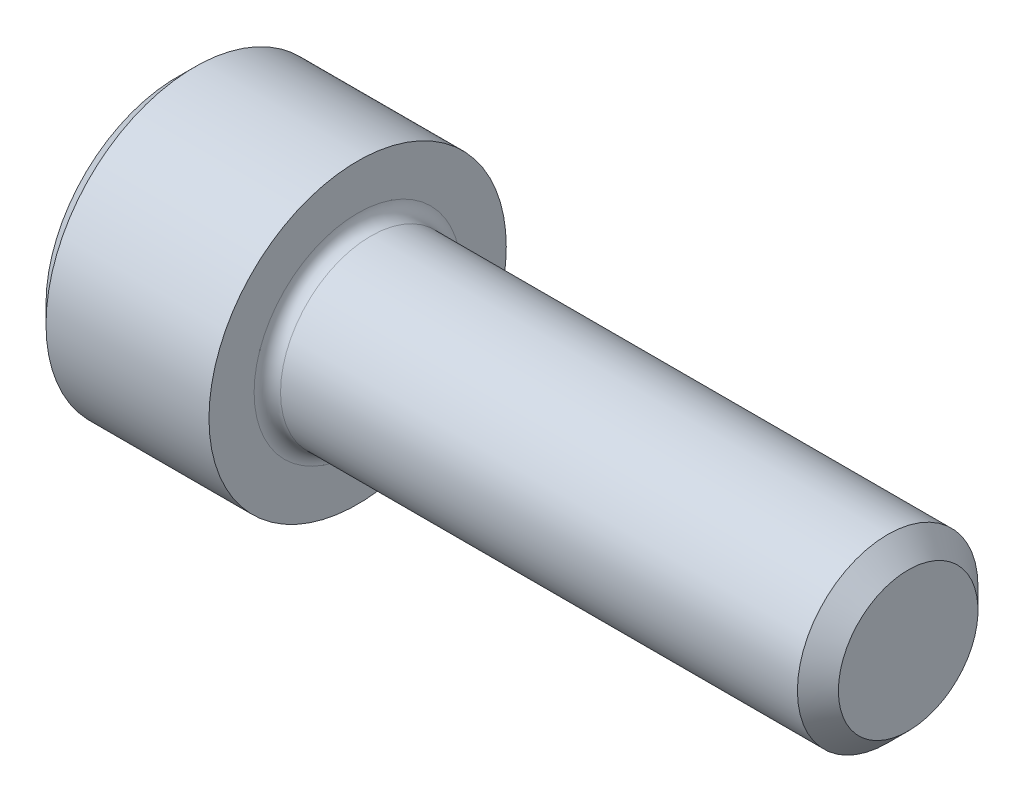
ISO-10303-21;
HEADER;
FILE_DESCRIPTION(('STEP AP214'),'2;1');
FILE_NAME('part.step','',(''),(''),'','','');
FILE_SCHEMA(('AUTOMOTIVE_DESIGN { 1 0 10303 214 1 1 1 1 }'));
ENDSEC;
DATA;
#1=APPLICATION_CONTEXT('core data for automotive mechanical design processes');
#2=APPLICATION_PROTOCOL_DEFINITION('international standard','automotive_design',2000,#1);
#3=PRODUCT_CONTEXT('',#1,'mechanical');
#4=PRODUCT('Part','Part','',(#3));
#5=PRODUCT_RELATED_PRODUCT_CATEGORY('part','',(#4));
#6=PRODUCT_DEFINITION_FORMATION('','',#4);
#7=PRODUCT_DEFINITION_CONTEXT('part definition',#1,'design');
#8=PRODUCT_DEFINITION('design','',#6,#7);
#9=PRODUCT_DEFINITION_SHAPE('','',#8);
#10=(LENGTH_UNIT() NAMED_UNIT(*) SI_UNIT(.MILLI.,.METRE.));
#11=(NAMED_UNIT(*) PLANE_ANGLE_UNIT() SI_UNIT($,.RADIAN.));
#12=(NAMED_UNIT(*) SI_UNIT($,.STERADIAN.) SOLID_ANGLE_UNIT());
#13=UNCERTAINTY_MEASURE_WITH_UNIT(LENGTH_MEASURE(1.E-05),#10,'distance_accuracy_value','');
#14=(GEOMETRIC_REPRESENTATION_CONTEXT(3) GLOBAL_UNCERTAINTY_ASSIGNED_CONTEXT((#13)) GLOBAL_UNIT_ASSIGNED_CONTEXT((#10,
#11,#12)) REPRESENTATION_CONTEXT('',''));
#15=CARTESIAN_POINT('',(0.,0.,0.));
#16=DIRECTION('',(0.,0.,1.));
#17=DIRECTION('',(1.,0.,0.));
#18=AXIS2_PLACEMENT_3D('',#15,#16,#17);
#19=CARTESIAN_POINT('',(0.,0.,0.));
#20=DIRECTION('',(-1.,0.,0.));
#21=DIRECTION('',(0.,0.,1.));
#22=AXIS2_PLACEMENT_3D('',#19,#20,#21);
#23=PLANE('',#22);
#24=DIRECTION('',(0.,-0.499999999999998,0.86602540378444));
#25=VECTOR('',#24,1.);
#26=CARTESIAN_POINT('',(0.,2.05305755723831,0.));
#27=LINE('',#26,#25);
#28=CARTESIAN_POINT('',(0.,2.05305755723831,0.));
#29=VERTEX_POINT('',#28);
#30=CARTESIAN_POINT('',(0.,1.02652877861916,1.778));
#31=VERTEX_POINT('',#30);
#32=EDGE_CURVE('E381',#29,#31,#27,.T.);
#33=ORIENTED_EDGE('',*,*,#32,.T.);
#34=DIRECTION('',(0.,1.,0.));
#35=VECTOR('',#34,1.);
#36=CARTESIAN_POINT('',(0.,-1.02652877861915,1.778));
#37=LINE('',#36,#35);
#38=CARTESIAN_POINT('',(0.,-1.02652877861915,1.778));
#39=VERTEX_POINT('',#38);
#40=EDGE_CURVE('E132',#39,#31,#37,.T.);
#41=ORIENTED_EDGE('',*,*,#40,.F.);
#42=DIRECTION('',(0.,-0.500000000000001,-0.866025403784438));
#43=VECTOR('',#42,1.);
#44=CARTESIAN_POINT('',(0.,-1.02652877861915,1.778));
#45=LINE('',#44,#43);
#46=CARTESIAN_POINT('',(0.,-2.05305755723831,0.));
#47=VERTEX_POINT('',#46);
#48=EDGE_CURVE('E390',#39,#47,#45,.T.);
#49=ORIENTED_EDGE('',*,*,#48,.T.);
#50=DIRECTION('',(0.,0.499999999999998,-0.866025403784439));
#51=VECTOR('',#50,1.);
#52=CARTESIAN_POINT('',(0.,-2.05305755723831,0.));
#53=LINE('',#52,#51);
#54=CARTESIAN_POINT('',(0.,-1.02652877861916,-1.778));
#55=VERTEX_POINT('',#54);
#56=EDGE_CURVE('E387',#47,#55,#53,.T.);
#57=ORIENTED_EDGE('',*,*,#56,.T.);
#58=DIRECTION('',(0.,-1.,0.));
#59=VECTOR('',#58,1.);
#60=CARTESIAN_POINT('',(0.,1.02652877861915,-1.778));
#61=LINE('',#60,#59);
#62=CARTESIAN_POINT('',(0.,1.02652877861915,-1.778));
#63=VERTEX_POINT('',#62);
#64=EDGE_CURVE('E391',#63,#55,#61,.T.);
#65=ORIENTED_EDGE('',*,*,#64,.F.);
#66=DIRECTION('',(0.,-0.500000000000001,-0.866025403784438));
#67=VECTOR('',#66,1.);
#68=CARTESIAN_POINT('',(0.,2.05305755723831,0.));
#69=LINE('',#68,#67);
#70=EDGE_CURVE('E127',#29,#63,#69,.T.);
#71=ORIENTED_EDGE('',*,*,#70,.F.);
#72=EDGE_LOOP('',(#33,#41,#49,#57,#65,#71));
#73=FACE_BOUND('',#72,.T.);
#74=CARTESIAN_POINT('',(0.,0.,0.));
#75=DIRECTION('',(-1.,0.,0.));
#76=DIRECTION('',(0.,0.,1.));
#77=AXIS2_PLACEMENT_3D('',#74,#75,#76);
#78=CIRCLE('',#77,3.0226);
#79=CARTESIAN_POINT('',(0.,0.,3.0226));
#80=VERTEX_POINT('',#79);
#81=EDGE_CURVE('E148',#80,#80,#78,.T.);
#82=ORIENTED_EDGE('',*,*,#81,.T.);
#83=EDGE_LOOP('',(#82));
#84=FACE_BOUND('',#83,.T.);
#85=ADVANCED_FACE('F39',(#73,#84),#23,.T.);
#86=CARTESIAN_POINT('',(16.8656,1.61036,0.));
#87=DIRECTION('',(1.,0.,0.));
#88=DIRECTION('',(0.,0.,-1.));
#89=AXIS2_PLACEMENT_3D('',#86,#87,#88);
#90=PLANE('',#89);
#91=CARTESIAN_POINT('',(16.8656,0.,0.));
#92=DIRECTION('',(-1.,0.,0.));
#93=DIRECTION('',(0.,0.,1.));
#94=AXIS2_PLACEMENT_3D('',#91,#92,#93);
#95=CIRCLE('',#94,1.61036);
#96=CARTESIAN_POINT('',(16.8656,0.,1.61036));
#97=VERTEX_POINT('',#96);
#98=EDGE_CURVE('E160',#97,#97,#95,.T.);
#99=ORIENTED_EDGE('',*,*,#98,.F.);
#100=EDGE_LOOP('',(#99));
#101=FACE_BOUND('',#100,.T.);
#102=ADVANCED_FACE('F181',(#101),#90,.T.);
#103=CARTESIAN_POINT('',(16.8656,0.,0.));
#104=DIRECTION('',(-1.,0.,0.));
#105=DIRECTION('',(0.,0.,1.));
#106=AXIS2_PLACEMENT_3D('',#103,#104,#105);
#107=CONICAL_SURFACE('',#106,1.61036,0.785398163397526);
#108=CARTESIAN_POINT('',(16.39316,0.,0.));
#109=DIRECTION('',(-1.,0.,0.));
#110=DIRECTION('',(0.,0.,1.));
#111=AXIS2_PLACEMENT_3D('',#108,#109,#110);
#112=CIRCLE('',#111,2.08280000000003);
#113=CARTESIAN_POINT('',(16.39316,0.,2.08280000000003));
#114=VERTEX_POINT('',#113);
#115=EDGE_CURVE('E158',#114,#114,#112,.T.);
#116=ORIENTED_EDGE('',*,*,#115,.F.);
#117=EDGE_LOOP('',(#116));
#118=FACE_BOUND('',#117,.T.);
#119=ORIENTED_EDGE('',*,*,#98,.T.);
#120=EDGE_LOOP('',(#119));
#121=FACE_BOUND('',#120,.T.);
#122=ADVANCED_FACE('F190',(#118,#121),#107,.T.);
#123=CARTESIAN_POINT('',(-31.75,0.,0.));
#124=DIRECTION('',(-1.,0.,0.));
#125=DIRECTION('',(0.,0.,1.));
#126=AXIS2_PLACEMENT_3D('',#123,#124,#125);
#127=CYLINDRICAL_SURFACE('',#126,2.08280000000001);
#128=CARTESIAN_POINT('',(4.4704,0.,0.));
#129=DIRECTION('',(1.,0.,0.));
#130=DIRECTION('',(0.,0.,-1.));
#131=AXIS2_PLACEMENT_3D('',#128,#129,#130);
#132=CIRCLE('',#131,2.08280000000001);
#133=CARTESIAN_POINT('',(4.4704,0.,-2.08280000000001));
#134=VERTEX_POINT('',#133);
#135=EDGE_CURVE('E11',#134,#134,#132,.T.);
#136=ORIENTED_EDGE('',*,*,#135,.T.);
#137=EDGE_LOOP('',(#136));
#138=FACE_BOUND('',#137,.T.);
#139=ORIENTED_EDGE('',*,*,#115,.T.);
#140=EDGE_LOOP('',(#139));
#141=FACE_BOUND('',#140,.T.);
#142=ADVANCED_FACE('F200',(#138,#141),#127,.T.);
#143=CARTESIAN_POINT('',(4.1656,3.429,0.));
#144=DIRECTION('',(1.,0.,0.));
#145=DIRECTION('',(0.,0.,-1.));
#146=AXIS2_PLACEMENT_3D('',#143,#144,#145);
#147=PLANE('',#146);
#148=CARTESIAN_POINT('',(4.1656,0.,0.));
#149=DIRECTION('',(1.,0.,0.));
#150=DIRECTION('',(0.,0.,-1.));
#151=AXIS2_PLACEMENT_3D('',#148,#149,#150);
#152=CIRCLE('',#151,2.38760000000001);
#153=CARTESIAN_POINT('',(4.1656,0.,-2.38760000000001));
#154=VERTEX_POINT('',#153);
#155=EDGE_CURVE('E50',#154,#154,#152,.F.);
#156=ORIENTED_EDGE('',*,*,#155,.T.);
#157=EDGE_LOOP('',(#156));
#158=FACE_BOUND('',#157,.T.);
#159=CARTESIAN_POINT('',(4.1656,0.,0.));
#160=DIRECTION('',(-1.,0.,0.));
#161=DIRECTION('',(0.,0.,1.));
#162=AXIS2_PLACEMENT_3D('',#159,#160,#161);
#163=CIRCLE('',#162,3.429);
#164=CARTESIAN_POINT('',(4.1656,0.,3.429));
#165=VERTEX_POINT('',#164);
#166=EDGE_CURVE('E151',#165,#165,#163,.T.);
#167=ORIENTED_EDGE('',*,*,#166,.F.);
#168=EDGE_LOOP('',(#167));
#169=FACE_BOUND('',#168,.T.);
#170=ADVANCED_FACE('F165',(#158,#169),#147,.T.);
#171=CARTESIAN_POINT('',(-31.75,0.,0.));
#172=DIRECTION('',(-1.,0.,0.));
#173=DIRECTION('',(0.,0.,1.));
#174=AXIS2_PLACEMENT_3D('',#171,#172,#173);
#175=CYLINDRICAL_SURFACE('',#174,3.429);
#176=ORIENTED_EDGE('',*,*,#166,.T.);
#177=EDGE_LOOP('',(#176));
#178=FACE_BOUND('',#177,.T.);
#179=CARTESIAN_POINT('',(0.406400000000001,0.,0.));
#180=DIRECTION('',(-1.,0.,0.));
#181=DIRECTION('',(0.,0.,1.));
#182=AXIS2_PLACEMENT_3D('',#179,#180,#181);
#183=CIRCLE('',#182,3.429);
#184=CARTESIAN_POINT('',(0.406400000000001,0.,3.429));
#185=VERTEX_POINT('',#184);
#186=EDGE_CURVE('E147',#185,#185,#183,.T.);
#187=ORIENTED_EDGE('',*,*,#186,.F.);
#188=EDGE_LOOP('',(#187));
#189=FACE_BOUND('',#188,.T.);
#190=ADVANCED_FACE('F180',(#178,#189),#175,.T.);
#191=CARTESIAN_POINT('',(0.,0.,0.));
#192=DIRECTION('',(1.,0.,0.));
#193=DIRECTION('',(0.,0.,-1.));
#194=AXIS2_PLACEMENT_3D('',#191,#192,#193);
#195=CONICAL_SURFACE('',#194,3.0226,0.785398163397449);
#196=ORIENTED_EDGE('',*,*,#186,.T.);
#197=EDGE_LOOP('',(#196));
#198=FACE_BOUND('',#197,.T.);
#199=ORIENTED_EDGE('',*,*,#81,.F.);
#200=EDGE_LOOP('',(#199));
#201=FACE_BOUND('',#200,.T.);
#202=ADVANCED_FACE('F166',(#198,#201),#195,.T.);
#203=CARTESIAN_POINT('',(4.4704,0.,0.));
#204=DIRECTION('',(1.,0.,0.));
#205=DIRECTION('',(0.,0.,-1.));
#206=AXIS2_PLACEMENT_3D('',#203,#204,#205);
#207=TOROIDAL_SURFACE('',#206,2.38760000000001,0.3048);
#208=ORIENTED_EDGE('',*,*,#135,.F.);
#209=EDGE_LOOP('',(#208));
#210=FACE_BOUND('',#209,.T.);
#211=ORIENTED_EDGE('',*,*,#155,.F.);
#212=EDGE_LOOP('',(#211));
#213=FACE_BOUND('',#212,.T.);
#214=ADVANCED_FACE('F41',(#210,#213),#207,.F.);
#215=CARTESIAN_POINT('',(1.9558,2.05305755723831,0.));
#216=DIRECTION('',(0.,-0.86602540378444,-0.499999999999998));
#217=DIRECTION('',(0.,0.499999999999998,-0.86602540378444));
#218=AXIS2_PLACEMENT_3D('',#215,#216,#217);
#219=PLANE('',#218);
#220=ORIENTED_EDGE('',*,*,#32,.F.);
#221=DIRECTION('',(-1.,0.,0.));
#222=VECTOR('',#221,1.);
#223=CARTESIAN_POINT('',(1.9558,2.05305755723831,0.));
#224=LINE('',#223,#222);
#225=CARTESIAN_POINT('',(1.9558,2.05305755723831,0.));
#226=VERTEX_POINT('',#225);
#227=EDGE_CURVE('E372',#226,#29,#224,.T.);
#228=ORIENTED_EDGE('',*,*,#227,.F.);
#229=DIRECTION('',(0.,-0.499999999999998,0.86602540378444));
#230=VECTOR('',#229,1.);
#231=CARTESIAN_POINT('',(1.9558,2.05305755723831,0.));
#232=LINE('',#231,#230);
#233=CARTESIAN_POINT('',(1.9558,1.53979316792873,0.888999999999997));
#234=VERTEX_POINT('',#233);
#235=EDGE_CURVE('E125',#226,#234,#232,.T.);
#236=ORIENTED_EDGE('',*,*,#235,.T.);
#237=CARTESIAN_POINT('',(1.9558,1.02652877861916,1.778));
#238=VERTEX_POINT('',#237);
#239=EDGE_CURVE('E113',#234,#238,#232,.T.);
#240=ORIENTED_EDGE('',*,*,#239,.T.);
#241=DIRECTION('',(-1.,0.,0.));
#242=VECTOR('',#241,1.);
#243=CARTESIAN_POINT('',(1.9558,1.02652877861916,1.778));
#244=LINE('',#243,#242);
#245=EDGE_CURVE('E130',#238,#31,#244,.T.);
#246=ORIENTED_EDGE('',*,*,#245,.T.);
#247=EDGE_LOOP('',(#220,#228,#236,#240,#246));
#248=FACE_BOUND('',#247,.T.);
#249=ADVANCED_FACE('F128',(#248),#219,.T.);
#250=CARTESIAN_POINT('',(1.9558,-1.02652877861915,1.778));
#251=DIRECTION('',(0.,0.,1.));
#252=DIRECTION('',(0.,-1.,0.));
#253=AXIS2_PLACEMENT_3D('',#250,#251,#252);
#254=PLANE('',#253);
#255=ORIENTED_EDGE('',*,*,#40,.T.);
#256=ORIENTED_EDGE('',*,*,#245,.F.);
#257=DIRECTION('',(0.,1.,0.));
#258=VECTOR('',#257,1.);
#259=CARTESIAN_POINT('',(1.9558,-1.02652877861915,1.778));
#260=LINE('',#259,#258);
#261=CARTESIAN_POINT('',(1.9558,0.,1.778));
#262=VERTEX_POINT('',#261);
#263=EDGE_CURVE('E109',#262,#238,#260,.T.);
#264=ORIENTED_EDGE('',*,*,#263,.F.);
#265=CARTESIAN_POINT('',(1.9558,-1.02652877861915,1.778));
#266=VERTEX_POINT('',#265);
#267=EDGE_CURVE('E122',#266,#262,#260,.T.);
#268=ORIENTED_EDGE('',*,*,#267,.F.);
#269=DIRECTION('',(-1.,0.,0.));
#270=VECTOR('',#269,1.);
#271=CARTESIAN_POINT('',(1.9558,-1.02652877861915,1.778));
#272=LINE('',#271,#270);
#273=EDGE_CURVE('E139',#266,#39,#272,.T.);
#274=ORIENTED_EDGE('',*,*,#273,.T.);
#275=EDGE_LOOP('',(#255,#256,#264,#268,#274));
#276=FACE_BOUND('',#275,.T.);
#277=ADVANCED_FACE('F135',(#276),#254,.F.);
#278=CARTESIAN_POINT('',(1.9558,-1.02652877861915,1.778));
#279=DIRECTION('',(0.,0.866025403784438,-0.500000000000001));
#280=DIRECTION('',(0.,0.500000000000001,0.866025403784438));
#281=AXIS2_PLACEMENT_3D('',#278,#279,#280);
#282=PLANE('',#281);
#283=ORIENTED_EDGE('',*,*,#48,.F.);
#284=ORIENTED_EDGE('',*,*,#273,.F.);
#285=DIRECTION('',(0.,-0.500000000000001,-0.866025403784438));
#286=VECTOR('',#285,1.);
#287=CARTESIAN_POINT('',(1.9558,-1.02652877861915,1.778));
#288=LINE('',#287,#286);
#289=CARTESIAN_POINT('',(1.9558,-1.53979316792873,0.889000000000001));
#290=VERTEX_POINT('',#289);
#291=EDGE_CURVE('E411',#266,#290,#288,.T.);
#292=ORIENTED_EDGE('',*,*,#291,.T.);
#293=CARTESIAN_POINT('',(1.9558,-2.05305755723831,0.));
#294=VERTEX_POINT('',#293);
#295=EDGE_CURVE('E405',#290,#294,#288,.T.);
#296=ORIENTED_EDGE('',*,*,#295,.T.);
#297=DIRECTION('',(-1.,0.,0.));
#298=VECTOR('',#297,1.);
#299=CARTESIAN_POINT('',(1.9558,-2.05305755723831,0.));
#300=LINE('',#299,#298);
#301=EDGE_CURVE('E145',#294,#47,#300,.T.);
#302=ORIENTED_EDGE('',*,*,#301,.T.);
#303=EDGE_LOOP('',(#283,#284,#292,#296,#302));
#304=FACE_BOUND('',#303,.T.);
#305=ADVANCED_FACE('F261',(#304),#282,.T.);
#306=CARTESIAN_POINT('',(1.9558,-2.05305755723831,0.));
#307=DIRECTION('',(0.,0.86602540378444,0.499999999999998));
#308=DIRECTION('',(0.,-0.499999999999998,0.86602540378444));
#309=AXIS2_PLACEMENT_3D('',#306,#307,#308);
#310=PLANE('',#309);
#311=ORIENTED_EDGE('',*,*,#56,.F.);
#312=ORIENTED_EDGE('',*,*,#301,.F.);
#313=DIRECTION('',(0.,0.499999999999998,-0.866025403784439));
#314=VECTOR('',#313,1.);
#315=CARTESIAN_POINT('',(1.9558,-2.05305755723831,0.));
#316=LINE('',#315,#314);
#317=CARTESIAN_POINT('',(1.9558,-1.53979316792873,-0.888999999999997));
#318=VERTEX_POINT('',#317);
#319=EDGE_CURVE('E379',#294,#318,#316,.T.);
#320=ORIENTED_EDGE('',*,*,#319,.T.);
#321=CARTESIAN_POINT('',(1.9558,-1.02652877861916,-1.778));
#322=VERTEX_POINT('',#321);
#323=EDGE_CURVE('E415',#318,#322,#316,.T.);
#324=ORIENTED_EDGE('',*,*,#323,.T.);
#325=DIRECTION('',(-1.,0.,0.));
#326=VECTOR('',#325,1.);
#327=CARTESIAN_POINT('',(1.9558,-1.02652877861916,-1.778));
#328=LINE('',#327,#326);
#329=EDGE_CURVE('E373',#322,#55,#328,.T.);
#330=ORIENTED_EDGE('',*,*,#329,.T.);
#331=EDGE_LOOP('',(#311,#312,#320,#324,#330));
#332=FACE_BOUND('',#331,.T.);
#333=ADVANCED_FACE('F272',(#332),#310,.T.);
#334=CARTESIAN_POINT('',(1.9558,1.02652877861915,-1.778));
#335=DIRECTION('',(0.,0.,-1.));
#336=DIRECTION('',(0.,1.,0.));
#337=AXIS2_PLACEMENT_3D('',#334,#335,#336);
#338=PLANE('',#337);
#339=ORIENTED_EDGE('',*,*,#64,.T.);
#340=ORIENTED_EDGE('',*,*,#329,.F.);
#341=DIRECTION('',(0.,-1.,0.));
#342=VECTOR('',#341,1.);
#343=CARTESIAN_POINT('',(1.9558,1.02652877861915,-1.778));
#344=LINE('',#343,#342);
#345=CARTESIAN_POINT('',(1.9558,0.,-1.778));
#346=VERTEX_POINT('',#345);
#347=EDGE_CURVE('E380',#346,#322,#344,.T.);
#348=ORIENTED_EDGE('',*,*,#347,.F.);
#349=CARTESIAN_POINT('',(1.9558,1.02652877861915,-1.778));
#350=VERTEX_POINT('',#349);
#351=EDGE_CURVE('E53',#350,#346,#344,.T.);
#352=ORIENTED_EDGE('',*,*,#351,.F.);
#353=DIRECTION('',(-1.,0.,0.));
#354=VECTOR('',#353,1.);
#355=CARTESIAN_POINT('',(1.9558,1.02652877861915,-1.778));
#356=LINE('',#355,#354);
#357=EDGE_CURVE('E369',#350,#63,#356,.T.);
#358=ORIENTED_EDGE('',*,*,#357,.T.);
#359=EDGE_LOOP('',(#339,#340,#348,#352,#358));
#360=FACE_BOUND('',#359,.T.);
#361=ADVANCED_FACE('F277',(#360),#338,.F.);
#362=CARTESIAN_POINT('',(1.9558,2.05305755723831,0.));
#363=DIRECTION('',(0.,0.866025403784438,-0.500000000000001));
#364=DIRECTION('',(0.,0.500000000000001,0.866025403784438));
#365=AXIS2_PLACEMENT_3D('',#362,#363,#364);
#366=PLANE('',#365);
#367=ORIENTED_EDGE('',*,*,#70,.T.);
#368=ORIENTED_EDGE('',*,*,#357,.F.);
#369=DIRECTION('',(0.,-0.500000000000001,-0.866025403784438));
#370=VECTOR('',#369,1.);
#371=CARTESIAN_POINT('',(1.9558,2.05305755723831,0.));
#372=LINE('',#371,#370);
#373=CARTESIAN_POINT('',(1.9558,1.53979316792873,-0.889000000000001));
#374=VERTEX_POINT('',#373);
#375=EDGE_CURVE('E359',#374,#350,#372,.T.);
#376=ORIENTED_EDGE('',*,*,#375,.F.);
#377=EDGE_CURVE('E366',#226,#374,#372,.T.);
#378=ORIENTED_EDGE('',*,*,#377,.F.);
#379=ORIENTED_EDGE('',*,*,#227,.T.);
#380=EDGE_LOOP('',(#367,#368,#376,#378,#379));
#381=FACE_BOUND('',#380,.T.);
#382=ADVANCED_FACE('F290',(#381),#366,.F.);
#383=CARTESIAN_POINT('',(1.9558,3.07958633585746,-1.778));
#384=DIRECTION('',(1.,0.,0.));
#385=DIRECTION('',(0.,0.,-1.));
#386=AXIS2_PLACEMENT_3D('',#383,#384,#385);
#387=PLANE('',#386);
#388=ORIENTED_EDGE('',*,*,#347,.T.);
#389=ORIENTED_EDGE('',*,*,#323,.F.);
#390=CARTESIAN_POINT('',(1.9558,0.,0.));
#391=DIRECTION('',(-1.,0.,0.));
#392=DIRECTION('',(0.,0.,1.));
#393=AXIS2_PLACEMENT_3D('',#390,#391,#392);
#394=CIRCLE('',#393,1.778);
#395=EDGE_CURVE('E406',#346,#318,#394,.T.);
#396=ORIENTED_EDGE('',*,*,#395,.F.);
#397=EDGE_LOOP('',(#388,#389,#396));
#398=FACE_BOUND('',#397,.T.);
#399=ADVANCED_FACE('F296',(#398),#387,.F.);
#400=ORIENTED_EDGE('',*,*,#319,.F.);
#401=ORIENTED_EDGE('',*,*,#295,.F.);
#402=EDGE_CURVE('E136',#318,#290,#394,.T.);
#403=ORIENTED_EDGE('',*,*,#402,.F.);
#404=EDGE_LOOP('',(#400,#401,#403));
#405=FACE_BOUND('',#404,.T.);
#406=ADVANCED_FACE('F310',(#405),#387,.F.);
#407=ORIENTED_EDGE('',*,*,#291,.F.);
#408=ORIENTED_EDGE('',*,*,#267,.T.);
#409=EDGE_CURVE('E138',#290,#262,#394,.T.);
#410=ORIENTED_EDGE('',*,*,#409,.F.);
#411=EDGE_LOOP('',(#407,#408,#410));
#412=FACE_BOUND('',#411,.T.);
#413=ADVANCED_FACE('F317',(#412),#387,.F.);
#414=ORIENTED_EDGE('',*,*,#263,.T.);
#415=ORIENTED_EDGE('',*,*,#239,.F.);
#416=EDGE_CURVE('E116',#262,#234,#394,.T.);
#417=ORIENTED_EDGE('',*,*,#416,.F.);
#418=EDGE_LOOP('',(#414,#415,#417));
#419=FACE_BOUND('',#418,.T.);
#420=ADVANCED_FACE('F115',(#419),#387,.F.);
#421=ORIENTED_EDGE('',*,*,#235,.F.);
#422=ORIENTED_EDGE('',*,*,#377,.T.);
#423=EDGE_CURVE('E150',#234,#374,#394,.T.);
#424=ORIENTED_EDGE('',*,*,#423,.F.);
#425=EDGE_LOOP('',(#421,#422,#424));
#426=FACE_BOUND('',#425,.T.);
#427=ADVANCED_FACE('F333',(#426),#387,.F.);
#428=ORIENTED_EDGE('',*,*,#375,.T.);
#429=ORIENTED_EDGE('',*,*,#351,.T.);
#430=EDGE_CURVE('E361',#374,#346,#394,.T.);
#431=ORIENTED_EDGE('',*,*,#430,.F.);
#432=EDGE_LOOP('',(#428,#429,#431));
#433=FACE_BOUND('',#432,.T.);
#434=ADVANCED_FACE('F246',(#433),#387,.F.);
#435=CARTESIAN_POINT('',(1.9558,0.,0.));
#436=DIRECTION('',(-1.,0.,0.));
#437=DIRECTION('',(0.,0.,1.));
#438=AXIS2_PLACEMENT_3D('',#435,#436,#437);
#439=CONICAL_SURFACE('',#438,1.778,1.04719755119659);
#440=CARTESIAN_POINT('',(2.98232877861917,0.,0.));
#441=VERTEX_POINT('',#440);
#442=VERTEX_LOOP('',#441);
#443=FACE_BOUND('',#442,.T.);
#444=ORIENTED_EDGE('',*,*,#416,.T.);
#445=ORIENTED_EDGE('',*,*,#423,.T.);
#446=ORIENTED_EDGE('',*,*,#430,.T.);
#447=ORIENTED_EDGE('',*,*,#395,.T.);
#448=ORIENTED_EDGE('',*,*,#402,.T.);
#449=ORIENTED_EDGE('',*,*,#409,.T.);
#450=EDGE_LOOP('',(#444,#445,#446,#447,#448,#449));
#451=FACE_BOUND('',#450,.T.);
#452=ADVANCED_FACE('F193',(#443,#451),#439,.F.);
#453=CLOSED_SHELL('',(#85,#102,#122,#142,#170,#190,#202,#214,#249,#277,#305,#333,#361,#382,#399,
#406,#413,#420,#427,#434,#452));
#454=MANIFOLD_SOLID_BREP('B2',#453);
#455=ADVANCED_BREP_SHAPE_REPRESENTATION('',(#18,#454),#14);
#456=SHAPE_DEFINITION_REPRESENTATION(#9,#455);
ENDSEC;
END-ISO-10303-21;
